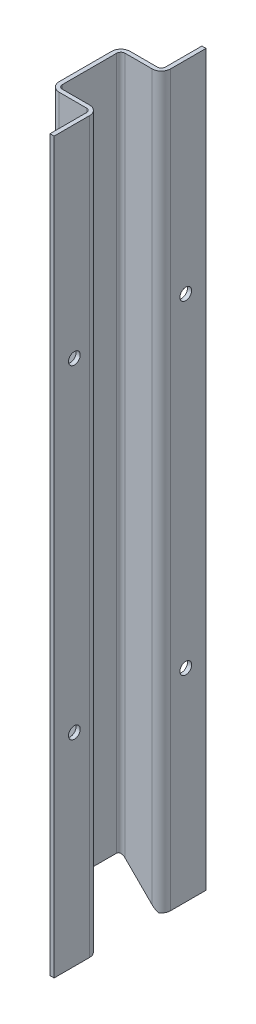
ISO-10303-21;
HEADER;
FILE_DESCRIPTION(('STEP AP214'),'2;1');
FILE_NAME('part.step','',(''),(''),'','','');
FILE_SCHEMA(('AUTOMOTIVE_DESIGN { 1 0 10303 214 1 1 1 1 }'));
ENDSEC;
DATA;
#1=APPLICATION_CONTEXT('core data for automotive mechanical design processes');
#2=APPLICATION_PROTOCOL_DEFINITION('international standard','automotive_design',2000,#1);
#3=PRODUCT_CONTEXT('',#1,'mechanical');
#4=PRODUCT('Part','Part','',(#3));
#5=PRODUCT_RELATED_PRODUCT_CATEGORY('part','',(#4));
#6=PRODUCT_DEFINITION_FORMATION('','',#4);
#7=PRODUCT_DEFINITION_CONTEXT('part definition',#1,'design');
#8=PRODUCT_DEFINITION('design','',#6,#7);
#9=PRODUCT_DEFINITION_SHAPE('','',#8);
#10=(LENGTH_UNIT() NAMED_UNIT(*) SI_UNIT(.MILLI.,.METRE.));
#11=(NAMED_UNIT(*) PLANE_ANGLE_UNIT() SI_UNIT($,.RADIAN.));
#12=(NAMED_UNIT(*) SI_UNIT($,.STERADIAN.) SOLID_ANGLE_UNIT());
#13=UNCERTAINTY_MEASURE_WITH_UNIT(LENGTH_MEASURE(1.E-05),#10,'distance_accuracy_value','');
#14=(GEOMETRIC_REPRESENTATION_CONTEXT(3) GLOBAL_UNCERTAINTY_ASSIGNED_CONTEXT((#13)) GLOBAL_UNIT_ASSIGNED_CONTEXT((#10,
#11,#12)) REPRESENTATION_CONTEXT('',''));
#15=CARTESIAN_POINT('',(0.,0.,0.));
#16=DIRECTION('',(0.,0.,1.));
#17=DIRECTION('',(1.,0.,0.));
#18=AXIS2_PLACEMENT_3D('',#15,#16,#17);
#19=CARTESIAN_POINT('',(162.383781401673,-457.2,-206.271000639954));
#20=DIRECTION('',(0.,0.,-1.));
#21=DIRECTION('',(-1.,0.,0.));
#22=AXIS2_PLACEMENT_3D('',#19,#20,#21);
#23=PLANE('',#22);
#24=DIRECTION('',(-0.707106781186548,0.707106781186548,0.));
#25=VECTOR('',#24,1.);
#26=CARTESIAN_POINT('',(164.092209600915,-446.208428199243,-206.271000639954));
#27=LINE('',#26,#25);
#28=CARTESIAN_POINT('',(172.492981401672,-454.6092,-206.271000639954));
#29=VERTEX_POINT('',#28);
#30=CARTESIAN_POINT('',(155.449581401673,-437.5658,-206.271000639954));
#31=VERTEX_POINT('',#30);
#32=EDGE_CURVE('E321',#29,#31,#27,.T.);
#33=ORIENTED_EDGE('',*,*,#32,.F.);
#34=DIRECTION('',(0.,1.,0.));
#35=VECTOR('',#34,1.);
#36=CARTESIAN_POINT('',(172.492981401672,-457.2,-206.271000639954));
#37=LINE('',#36,#35);
#38=CARTESIAN_POINT('',(172.492981401672,0.,-206.271000639954));
#39=VERTEX_POINT('',#38);
#40=EDGE_CURVE('E288',#29,#39,#37,.T.);
#41=ORIENTED_EDGE('',*,*,#40,.T.);
#42=DIRECTION('',(-1.,0.,0.));
#43=VECTOR('',#42,1.);
#44=CARTESIAN_POINT('',(162.383781401673,0.,-206.271000639954));
#45=LINE('',#44,#43);
#46=CARTESIAN_POINT('',(155.449581401673,0.,-206.271000639954));
#47=VERTEX_POINT('',#46);
#48=EDGE_CURVE('E378',#39,#47,#45,.T.);
#49=ORIENTED_EDGE('',*,*,#48,.T.);
#50=DIRECTION('',(0.,1.,0.));
#51=VECTOR('',#50,1.);
#52=CARTESIAN_POINT('',(155.449581401673,-457.2,-206.271000639954));
#53=LINE('',#52,#51);
#54=EDGE_CURVE('E262',#47,#31,#53,.F.);
#55=ORIENTED_EDGE('',*,*,#54,.T.);
#56=EDGE_LOOP('',(#33,#41,#49,#55));
#57=FACE_BOUND('',#56,.T.);
#58=ADVANCED_FACE('F16',(#57),#23,.F.);
#59=CARTESIAN_POINT('',(163.679181401673,-457.2,-228.496000639954));
#60=DIRECTION('',(0.,-1.,0.));
#61=DIRECTION('',(1.,0.,0.));
#62=AXIS2_PLACEMENT_3D('',#59,#60,#61);
#63=PLANE('',#62);
#64=DIRECTION('',(0.,0.,1.));
#65=VECTOR('',#64,1.);
#66=CARTESIAN_POINT('',(175.083781401672,-457.2,-250.721000639954));
#67=LINE('',#66,#65);
#68=CARTESIAN_POINT('',(175.083781401672,-457.2,-253.311800639953));
#69=VERTEX_POINT('',#68);
#70=CARTESIAN_POINT('',(175.083781401672,-457.2,-249.072959523616));
#71=VERTEX_POINT('',#70);
#72=EDGE_CURVE('E39',#69,#71,#67,.T.);
#73=ORIENTED_EDGE('',*,*,#72,.F.);
#74=DIRECTION('',(0.,0.,-1.));
#75=VECTOR('',#74,1.);
#76=CARTESIAN_POINT('',(175.083781401672,-457.2,-263.421000639953));
#77=LINE('',#76,#75);
#78=CARTESIAN_POINT('',(175.083781401672,-457.2,-276.121000639953));
#79=VERTEX_POINT('',#78);
#80=EDGE_CURVE('E374',#69,#79,#77,.T.);
#81=ORIENTED_EDGE('',*,*,#80,.T.);
#82=DIRECTION('',(1.,0.,0.));
#83=VECTOR('',#82,1.);
#84=CARTESIAN_POINT('',(176.379181401672,-457.2,-276.121000639953));
#85=LINE('',#84,#83);
#86=CARTESIAN_POINT('',(177.674581401672,-457.2,-276.121000639953));
#87=VERTEX_POINT('',#86);
#88=EDGE_CURVE('E377',#79,#87,#85,.T.);
#89=ORIENTED_EDGE('',*,*,#88,.T.);
#90=DIRECTION('',(0.,0.,1.));
#91=VECTOR('',#90,1.);
#92=CARTESIAN_POINT('',(177.674581401672,-457.2,-262.120520639953));
#93=LINE('',#92,#91);
#94=CARTESIAN_POINT('',(177.674581401672,-457.2,-253.885840639953));
#95=VERTEX_POINT('',#94);
#96=EDGE_CURVE('E381',#87,#95,#93,.T.);
#97=ORIENTED_EDGE('',*,*,#96,.T.);
#98=CARTESIAN_POINT('',(171.908781401672,-457.2,-253.885840639953));
#99=DIRECTION('',(0.,-1.,0.));
#100=DIRECTION('',(0.,0.,-1.));
#101=AXIS2_PLACEMENT_3D('',#98,#99,#100);
#102=CIRCLE('',#101,5.7658);
#103=EDGE_CURVE('E239',#95,#71,#102,.T.);
#104=ORIENTED_EDGE('',*,*,#103,.T.);
#105=EDGE_LOOP('',(#73,#81,#89,#97,#104));
#106=FACE_BOUND('',#105,.T.);
#107=ADVANCED_FACE('F483',(#106),#63,.T.);
#108=CARTESIAN_POINT('',(149.683781401672,-457.2,-228.496000639954));
#109=DIRECTION('',(1.,0.,0.));
#110=DIRECTION('',(0.,0.,-1.));
#111=AXIS2_PLACEMENT_3D('',#108,#109,#110);
#112=PLANE('',#111);
#113=DIRECTION('',(0.,1.,0.));
#114=VECTOR('',#113,1.);
#115=CARTESIAN_POINT('',(149.683781401672,-457.2,-244.955200639954));
#116=LINE('',#115,#114);
#117=CARTESIAN_POINT('',(149.683781401672,0.,-244.955200639954));
#118=VERTEX_POINT('',#117);
#119=CARTESIAN_POINT('',(149.683781401672,-431.8,-244.955200639954));
#120=VERTEX_POINT('',#119);
#121=EDGE_CURVE('E221',#118,#120,#116,.F.);
#122=ORIENTED_EDGE('',*,*,#121,.T.);
#123=DIRECTION('',(0.,0.,1.));
#124=VECTOR('',#123,1.);
#125=CARTESIAN_POINT('',(149.683781401672,-431.8,-250.721000639954));
#126=LINE('',#125,#124);
#127=CARTESIAN_POINT('',(149.683781401672,-431.8,-212.036800639953));
#128=VERTEX_POINT('',#127);
#129=EDGE_CURVE('E202',#120,#128,#126,.T.);
#130=ORIENTED_EDGE('',*,*,#129,.T.);
#131=DIRECTION('',(0.,1.,0.));
#132=VECTOR('',#131,1.);
#133=CARTESIAN_POINT('',(149.683781401672,-457.2,-212.036800639953));
#134=LINE('',#133,#132);
#135=CARTESIAN_POINT('',(149.683781401672,0.,-212.036800639953));
#136=VERTEX_POINT('',#135);
#137=EDGE_CURVE('E232',#128,#136,#134,.T.);
#138=ORIENTED_EDGE('',*,*,#137,.T.);
#139=DIRECTION('',(0.,0.,-1.));
#140=VECTOR('',#139,1.);
#141=CARTESIAN_POINT('',(149.683781401672,0.,-228.496000639954));
#142=LINE('',#141,#140);
#143=EDGE_CURVE('E224',#136,#118,#142,.T.);
#144=ORIENTED_EDGE('',*,*,#143,.T.);
#145=EDGE_LOOP('',(#122,#130,#138,#144));
#146=FACE_BOUND('',#145,.T.);
#147=ADVANCED_FACE('F228',(#146),#112,.F.);
#148=CARTESIAN_POINT('',(162.383781401673,-457.2,-250.721000639954));
#149=DIRECTION('',(0.,0.,1.));
#150=DIRECTION('',(1.,0.,0.));
#151=AXIS2_PLACEMENT_3D('',#148,#149,#150);
#152=PLANE('',#151);
#153=DIRECTION('',(1.,0.,0.));
#154=VECTOR('',#153,1.);
#155=CARTESIAN_POINT('',(162.383781401673,0.,-250.721000639954));
#156=LINE('',#155,#154);
#157=CARTESIAN_POINT('',(155.449581401673,0.,-250.721000639954));
#158=VERTEX_POINT('',#157);
#159=CARTESIAN_POINT('',(172.492981401672,0.,-250.721000639954));
#160=VERTEX_POINT('',#159);
#161=EDGE_CURVE('E399',#158,#160,#156,.T.);
#162=ORIENTED_EDGE('',*,*,#161,.T.);
#163=DIRECTION('',(0.,1.,0.));
#164=VECTOR('',#163,1.);
#165=CARTESIAN_POINT('',(172.492981401672,-457.2,-250.721000639954));
#166=LINE('',#165,#164);
#167=CARTESIAN_POINT('',(172.492981401672,-454.6092,-250.721000639954));
#168=VERTEX_POINT('',#167);
#169=EDGE_CURVE('E272',#160,#168,#166,.F.);
#170=ORIENTED_EDGE('',*,*,#169,.T.);
#171=DIRECTION('',(-0.707106781186548,0.707106781186548,0.));
#172=VECTOR('',#171,1.);
#173=CARTESIAN_POINT('',(164.092209600915,-446.208428199243,-250.721000639954));
#174=LINE('',#173,#172);
#175=CARTESIAN_POINT('',(155.449581401673,-437.5658,-250.721000639954));
#176=VERTEX_POINT('',#175);
#177=EDGE_CURVE('E215',#168,#176,#174,.T.);
#178=ORIENTED_EDGE('',*,*,#177,.T.);
#179=DIRECTION('',(0.,1.,0.));
#180=VECTOR('',#179,1.);
#181=CARTESIAN_POINT('',(155.449581401673,-457.2,-250.721000639954));
#182=LINE('',#181,#180);
#183=EDGE_CURVE('E222',#176,#158,#182,.T.);
#184=ORIENTED_EDGE('',*,*,#183,.T.);
#185=EDGE_LOOP('',(#162,#170,#178,#184));
#186=FACE_BOUND('',#185,.T.);
#187=ADVANCED_FACE('F470',(#186),#152,.F.);
#188=CARTESIAN_POINT('',(175.083781401672,-457.2,-263.421000639953));
#189=DIRECTION('',(1.,0.,0.));
#190=DIRECTION('',(0.,0.,-1.));
#191=AXIS2_PLACEMENT_3D('',#188,#189,#190);
#192=PLANE('',#191);
#193=CARTESIAN_POINT('',(175.083781401672,-330.2,-263.421000639953));
#194=DIRECTION('',(1.,0.,0.));
#195=DIRECTION('',(0.,0.,-1.));
#196=AXIS2_PLACEMENT_3D('',#193,#194,#195);
#197=CIRCLE('',#196,3.683);
#198=CARTESIAN_POINT('',(175.083781401672,-330.2,-267.104000639953));
#199=VERTEX_POINT('',#198);
#200=EDGE_CURVE('E20',#199,#199,#197,.F.);
#201=ORIENTED_EDGE('',*,*,#200,.F.);
#202=EDGE_LOOP('',(#201));
#203=FACE_BOUND('',#202,.T.);
#204=CARTESIAN_POINT('',(175.083781401672,-127.,-263.421000639953));
#205=DIRECTION('',(1.,0.,0.));
#206=DIRECTION('',(0.,0.,-1.));
#207=AXIS2_PLACEMENT_3D('',#204,#205,#206);
#208=CIRCLE('',#207,3.683);
#209=CARTESIAN_POINT('',(175.083781401672,-127.,-267.104000639953));
#210=VERTEX_POINT('',#209);
#211=EDGE_CURVE('E327',#210,#210,#208,.F.);
#212=ORIENTED_EDGE('',*,*,#211,.F.);
#213=EDGE_LOOP('',(#212));
#214=FACE_BOUND('',#213,.T.);
#215=ORIENTED_EDGE('',*,*,#80,.F.);
#216=DIRECTION('',(0.,1.,0.));
#217=VECTOR('',#216,1.);
#218=CARTESIAN_POINT('',(175.083781401672,0.,-253.311800639953));
#219=LINE('',#218,#217);
#220=CARTESIAN_POINT('',(175.083781401672,0.,-253.311800639953));
#221=VERTEX_POINT('',#220);
#222=EDGE_CURVE('E268',#69,#221,#219,.T.);
#223=ORIENTED_EDGE('',*,*,#222,.T.);
#224=DIRECTION('',(0.,0.,-1.));
#225=VECTOR('',#224,1.);
#226=CARTESIAN_POINT('',(175.083781401672,0.,-263.421000639953));
#227=LINE('',#226,#225);
#228=CARTESIAN_POINT('',(175.083781401672,0.,-276.121000639953));
#229=VERTEX_POINT('',#228);
#230=EDGE_CURVE('E403',#221,#229,#227,.T.);
#231=ORIENTED_EDGE('',*,*,#230,.T.);
#232=DIRECTION('',(0.,1.,0.));
#233=VECTOR('',#232,1.);
#234=CARTESIAN_POINT('',(175.083781401672,-457.2,-276.121000639953));
#235=LINE('',#234,#233);
#236=EDGE_CURVE('E447',#79,#229,#235,.T.);
#237=ORIENTED_EDGE('',*,*,#236,.F.);
#238=EDGE_LOOP('',(#215,#223,#231,#237));
#239=FACE_BOUND('',#238,.T.);
#240=ADVANCED_FACE('F873',(#203,#214,#239),#192,.F.);
#241=CARTESIAN_POINT('',(176.379181401672,-457.2,-276.121000639953));
#242=DIRECTION('',(0.,0.,1.));
#243=DIRECTION('',(1.,0.,0.));
#244=AXIS2_PLACEMENT_3D('',#241,#242,#243);
#245=PLANE('',#244);
#246=DIRECTION('',(1.,0.,0.));
#247=VECTOR('',#246,1.);
#248=CARTESIAN_POINT('',(176.379181401672,0.,-276.121000639953));
#249=LINE('',#248,#247);
#250=CARTESIAN_POINT('',(177.674581401672,0.,-276.121000639953));
#251=VERTEX_POINT('',#250);
#252=EDGE_CURVE('E406',#229,#251,#249,.T.);
#253=ORIENTED_EDGE('',*,*,#252,.T.);
#254=DIRECTION('',(0.,1.,0.));
#255=VECTOR('',#254,1.);
#256=CARTESIAN_POINT('',(177.674581401672,-457.2,-276.121000639953));
#257=LINE('',#256,#255);
#258=EDGE_CURVE('E443',#87,#251,#257,.T.);
#259=ORIENTED_EDGE('',*,*,#258,.F.);
#260=ORIENTED_EDGE('',*,*,#88,.F.);
#261=ORIENTED_EDGE('',*,*,#236,.T.);
#262=EDGE_LOOP('',(#253,#259,#260,#261));
#263=FACE_BOUND('',#262,.T.);
#264=ADVANCED_FACE('F862',(#263),#245,.F.);
#265=CARTESIAN_POINT('',(177.674581401672,-457.2,-262.120520639953));
#266=DIRECTION('',(-1.,0.,0.));
#267=DIRECTION('',(0.,0.,1.));
#268=AXIS2_PLACEMENT_3D('',#265,#266,#267);
#269=PLANE('',#268);
#270=CARTESIAN_POINT('',(177.674581401672,-330.2,-263.421000639953));
#271=DIRECTION('',(1.,0.,0.));
#272=DIRECTION('',(0.,0.,-1.));
#273=AXIS2_PLACEMENT_3D('',#270,#271,#272);
#274=CIRCLE('',#273,3.683);
#275=CARTESIAN_POINT('',(177.674581401672,-330.2,-267.104000639953));
#276=VERTEX_POINT('',#275);
#277=EDGE_CURVE('E345',#276,#276,#274,.T.);
#278=ORIENTED_EDGE('',*,*,#277,.F.);
#279=EDGE_LOOP('',(#278));
#280=FACE_BOUND('',#279,.T.);
#281=CARTESIAN_POINT('',(177.674581401672,-127.,-263.421000639953));
#282=DIRECTION('',(1.,0.,0.));
#283=DIRECTION('',(0.,0.,-1.));
#284=AXIS2_PLACEMENT_3D('',#281,#282,#283);
#285=CIRCLE('',#284,3.683);
#286=CARTESIAN_POINT('',(177.674581401672,-127.,-267.104000639953));
#287=VERTEX_POINT('',#286);
#288=EDGE_CURVE('E330',#287,#287,#285,.T.);
#289=ORIENTED_EDGE('',*,*,#288,.F.);
#290=EDGE_LOOP('',(#289));
#291=FACE_BOUND('',#290,.T.);
#292=DIRECTION('',(0.,0.,1.));
#293=VECTOR('',#292,1.);
#294=CARTESIAN_POINT('',(177.674581401672,0.,-262.120520639953));
#295=LINE('',#294,#293);
#296=CARTESIAN_POINT('',(177.674581401672,0.,-253.885840639953));
#297=VERTEX_POINT('',#296);
#298=EDGE_CURVE('E409',#251,#297,#295,.T.);
#299=ORIENTED_EDGE('',*,*,#298,.T.);
#300=DIRECTION('',(0.,1.,0.));
#301=VECTOR('',#300,1.);
#302=CARTESIAN_POINT('',(177.674581401672,-457.2,-253.885840639953));
#303=LINE('',#302,#301);
#304=EDGE_CURVE('E251',#297,#95,#303,.F.);
#305=ORIENTED_EDGE('',*,*,#304,.T.);
#306=ORIENTED_EDGE('',*,*,#96,.F.);
#307=ORIENTED_EDGE('',*,*,#258,.T.);
#308=EDGE_LOOP('',(#299,#305,#306,#307));
#309=FACE_BOUND('',#308,.T.);
#310=ADVANCED_FACE('F488',(#280,#291,#309),#269,.F.);
#311=CARTESIAN_POINT('',(176.379181401672,-457.2,-248.120040639953));
#312=DIRECTION('',(0.,0.,-1.));
#313=DIRECTION('',(-1.,0.,0.));
#314=AXIS2_PLACEMENT_3D('',#311,#312,#313);
#315=PLANE('',#314);
#316=DIRECTION('',(-1.,0.,0.));
#317=VECTOR('',#316,1.);
#318=CARTESIAN_POINT('',(176.379181401672,0.,-248.120040639953));
#319=LINE('',#318,#317);
#320=CARTESIAN_POINT('',(171.908781401672,0.,-248.120040639953));
#321=VERTEX_POINT('',#320);
#322=CARTESIAN_POINT('',(154.875541401673,0.,-248.120040639953));
#323=VERTEX_POINT('',#322);
#324=EDGE_CURVE('E413',#321,#323,#319,.T.);
#325=ORIENTED_EDGE('',*,*,#324,.T.);
#326=DIRECTION('',(0.,1.,0.));
#327=VECTOR('',#326,1.);
#328=CARTESIAN_POINT('',(154.875541401673,-434.40096,-248.120040639953));
#329=LINE('',#328,#327);
#330=CARTESIAN_POINT('',(154.875541401673,-436.99176,-248.120040639953));
#331=VERTEX_POINT('',#330);
#332=EDGE_CURVE('E281',#323,#331,#329,.F.);
#333=ORIENTED_EDGE('',*,*,#332,.T.);
#334=DIRECTION('',(0.707106781186548,-0.707106781186548,0.));
#335=VECTOR('',#334,1.);
#336=CARTESIAN_POINT('',(175.731481401672,-457.8477,-248.120040639953));
#337=LINE('',#336,#335);
#338=CARTESIAN_POINT('',(171.908781401672,-454.025,-248.120040639953));
#339=VERTEX_POINT('',#338);
#340=EDGE_CURVE('E368',#331,#339,#337,.T.);
#341=ORIENTED_EDGE('',*,*,#340,.T.);
#342=DIRECTION('',(0.,1.,0.));
#343=VECTOR('',#342,1.);
#344=CARTESIAN_POINT('',(171.908781401672,-457.2,-248.120040639953));
#345=LINE('',#344,#343);
#346=EDGE_CURVE('E248',#339,#321,#345,.T.);
#347=ORIENTED_EDGE('',*,*,#346,.T.);
#348=EDGE_LOOP('',(#325,#333,#341,#347));
#349=FACE_BOUND('',#348,.T.);
#350=ADVANCED_FACE('F494',(#349),#315,.F.);
#351=CARTESIAN_POINT('',(152.284741401673,-457.2,-228.496000639954));
#352=DIRECTION('',(-1.,0.,0.));
#353=DIRECTION('',(0.,0.,1.));
#354=AXIS2_PLACEMENT_3D('',#351,#352,#353);
#355=PLANE('',#354);
#356=DIRECTION('',(0.,0.,-1.));
#357=VECTOR('',#356,1.);
#358=CARTESIAN_POINT('',(152.284741401673,-434.40096,-228.496000639954));
#359=LINE('',#358,#357);
#360=CARTESIAN_POINT('',(152.284741401673,-434.40096,-211.462760639954));
#361=VERTEX_POINT('',#360);
#362=CARTESIAN_POINT('',(152.284741401673,-434.40096,-245.529240639954));
#363=VERTEX_POINT('',#362);
#364=EDGE_CURVE('E364',#361,#363,#359,.T.);
#365=ORIENTED_EDGE('',*,*,#364,.T.);
#366=DIRECTION('',(0.,1.,0.));
#367=VECTOR('',#366,1.);
#368=CARTESIAN_POINT('',(152.284741401673,0.,-245.529240639954));
#369=LINE('',#368,#367);
#370=CARTESIAN_POINT('',(152.284741401673,0.,-245.529240639954));
#371=VERTEX_POINT('',#370);
#372=EDGE_CURVE('E278',#363,#371,#369,.T.);
#373=ORIENTED_EDGE('',*,*,#372,.T.);
#374=DIRECTION('',(0.,0.,1.));
#375=VECTOR('',#374,1.);
#376=CARTESIAN_POINT('',(152.284741401673,0.,-228.496000639954));
#377=LINE('',#376,#375);
#378=CARTESIAN_POINT('',(152.284741401673,0.,-211.462760639954));
#379=VERTEX_POINT('',#378);
#380=EDGE_CURVE('E417',#371,#379,#377,.T.);
#381=ORIENTED_EDGE('',*,*,#380,.T.);
#382=DIRECTION('',(0.,1.,0.));
#383=VECTOR('',#382,1.);
#384=CARTESIAN_POINT('',(152.284741401673,-434.40096,-211.462760639954));
#385=LINE('',#384,#383);
#386=EDGE_CURVE('E275',#379,#361,#385,.F.);
#387=ORIENTED_EDGE('',*,*,#386,.T.);
#388=EDGE_LOOP('',(#365,#373,#381,#387));
#389=FACE_BOUND('',#388,.T.);
#390=ADVANCED_FACE('F502',(#389),#355,.F.);
#391=CARTESIAN_POINT('',(163.684261401673,-457.2,-208.871960639953));
#392=DIRECTION('',(0.,0.,1.));
#393=DIRECTION('',(1.,0.,0.));
#394=AXIS2_PLACEMENT_3D('',#391,#392,#393);
#395=PLANE('',#394);
#396=DIRECTION('',(-0.707106781186548,0.707106781186548,0.));
#397=VECTOR('',#396,1.);
#398=CARTESIAN_POINT('',(169.384021401672,-451.50024,-208.871960639953));
#399=LINE('',#398,#397);
#400=CARTESIAN_POINT('',(171.908781401672,-454.025,-208.871960639953));
#401=VERTEX_POINT('',#400);
#402=CARTESIAN_POINT('',(154.875541401673,-436.99176,-208.871960639953));
#403=VERTEX_POINT('',#402);
#404=EDGE_CURVE('E360',#401,#403,#399,.T.);
#405=ORIENTED_EDGE('',*,*,#404,.T.);
#406=DIRECTION('',(0.,1.,0.));
#407=VECTOR('',#406,1.);
#408=CARTESIAN_POINT('',(154.875541401673,0.,-208.871960639953));
#409=LINE('',#408,#407);
#410=CARTESIAN_POINT('',(154.875541401673,0.,-208.871960639953));
#411=VERTEX_POINT('',#410);
#412=EDGE_CURVE('E284',#403,#411,#409,.T.);
#413=ORIENTED_EDGE('',*,*,#412,.T.);
#414=DIRECTION('',(1.,0.,0.));
#415=VECTOR('',#414,1.);
#416=CARTESIAN_POINT('',(163.684261401673,0.,-208.871960639953));
#417=LINE('',#416,#415);
#418=CARTESIAN_POINT('',(171.908781401672,0.,-208.871960639953));
#419=VERTEX_POINT('',#418);
#420=EDGE_CURVE('E421',#411,#419,#417,.T.);
#421=ORIENTED_EDGE('',*,*,#420,.T.);
#422=DIRECTION('',(0.,1.,0.));
#423=VECTOR('',#422,1.);
#424=CARTESIAN_POINT('',(171.908781401672,-457.2,-208.871960639953));
#425=LINE('',#424,#423);
#426=EDGE_CURVE('E258',#419,#401,#425,.F.);
#427=ORIENTED_EDGE('',*,*,#426,.T.);
#428=EDGE_LOOP('',(#405,#413,#421,#427));
#429=FACE_BOUND('',#428,.T.);
#430=ADVANCED_FACE('F509',(#429),#395,.F.);
#431=CARTESIAN_POINT('',(177.674581401672,-457.2,-194.871480639954));
#432=DIRECTION('',(1.,0.,0.));
#433=DIRECTION('',(0.,0.,-1.));
#434=AXIS2_PLACEMENT_3D('',#431,#432,#433);
#435=PLANE('',#434);
#436=CARTESIAN_POINT('',(177.674581401672,-127.,-193.571000639953));
#437=DIRECTION('',(1.,0.,0.));
#438=DIRECTION('',(0.,0.,-1.));
#439=AXIS2_PLACEMENT_3D('',#436,#437,#438);
#440=CIRCLE('',#439,3.683);
#441=CARTESIAN_POINT('',(177.674581401672,-127.,-197.254000639953));
#442=VERTEX_POINT('',#441);
#443=EDGE_CURVE('E326',#442,#442,#440,.T.);
#444=ORIENTED_EDGE('',*,*,#443,.F.);
#445=EDGE_LOOP('',(#444));
#446=FACE_BOUND('',#445,.T.);
#447=CARTESIAN_POINT('',(177.674581401672,-330.2,-193.571000639953));
#448=DIRECTION('',(1.,0.,0.));
#449=DIRECTION('',(0.,0.,-1.));
#450=AXIS2_PLACEMENT_3D('',#447,#448,#449);
#451=CIRCLE('',#450,3.683);
#452=CARTESIAN_POINT('',(177.674581401672,-330.2,-197.254000639953));
#453=VERTEX_POINT('',#452);
#454=EDGE_CURVE('E322',#453,#453,#451,.T.);
#455=ORIENTED_EDGE('',*,*,#454,.F.);
#456=EDGE_LOOP('',(#455));
#457=FACE_BOUND('',#456,.T.);
#458=DIRECTION('',(0.,0.,-1.));
#459=VECTOR('',#458,1.);
#460=CARTESIAN_POINT('',(177.674581401672,-457.2,-194.871480639954));
#461=LINE('',#460,#459);
#462=CARTESIAN_POINT('',(177.674581401672,-457.2,-180.871000639954));
#463=VERTEX_POINT('',#462);
#464=CARTESIAN_POINT('',(177.674581401672,-457.2,-203.106160639954));
#465=VERTEX_POINT('',#464);
#466=EDGE_CURVE('E385',#463,#465,#461,.T.);
#467=ORIENTED_EDGE('',*,*,#466,.T.);
#468=DIRECTION('',(0.,1.,0.));
#469=VECTOR('',#468,1.);
#470=CARTESIAN_POINT('',(177.674581401672,0.,-203.106160639954));
#471=LINE('',#470,#469);
#472=CARTESIAN_POINT('',(177.674581401672,0.,-203.106160639954));
#473=VERTEX_POINT('',#472);
#474=EDGE_CURVE('E254',#465,#473,#471,.T.);
#475=ORIENTED_EDGE('',*,*,#474,.T.);
#476=DIRECTION('',(0.,0.,-1.));
#477=VECTOR('',#476,1.);
#478=CARTESIAN_POINT('',(177.674581401672,0.,-194.871480639954));
#479=LINE('',#478,#477);
#480=CARTESIAN_POINT('',(177.674581401672,0.,-180.871000639954));
#481=VERTEX_POINT('',#480);
#482=EDGE_CURVE('E424',#481,#473,#479,.T.);
#483=ORIENTED_EDGE('',*,*,#482,.F.);
#484=DIRECTION('',(0.,1.,0.));
#485=VECTOR('',#484,1.);
#486=CARTESIAN_POINT('',(177.674581401672,-457.2,-180.871000639954));
#487=LINE('',#486,#485);
#488=EDGE_CURVE('E440',#463,#481,#487,.T.);
#489=ORIENTED_EDGE('',*,*,#488,.F.);
#490=EDGE_LOOP('',(#467,#475,#483,#489));
#491=FACE_BOUND('',#490,.T.);
#492=ADVANCED_FACE('F685',(#446,#457,#491),#435,.T.);
#493=CARTESIAN_POINT('',(176.379181401672,-457.2,-180.871000639954));
#494=DIRECTION('',(0.,0.,1.));
#495=DIRECTION('',(1.,0.,0.));
#496=AXIS2_PLACEMENT_3D('',#493,#494,#495);
#497=PLANE('',#496);
#498=DIRECTION('',(1.,0.,0.));
#499=VECTOR('',#498,1.);
#500=CARTESIAN_POINT('',(176.379181401672,0.,-180.871000639954));
#501=LINE('',#500,#499);
#502=CARTESIAN_POINT('',(175.083781401672,0.,-180.871000639954));
#503=VERTEX_POINT('',#502);
#504=EDGE_CURVE('E428',#503,#481,#501,.T.);
#505=ORIENTED_EDGE('',*,*,#504,.F.);
#506=DIRECTION('',(0.,1.,0.));
#507=VECTOR('',#506,1.);
#508=CARTESIAN_POINT('',(175.083781401672,-457.2,-180.871000639954));
#509=LINE('',#508,#507);
#510=CARTESIAN_POINT('',(175.083781401672,-457.2,-180.871000639954));
#511=VERTEX_POINT('',#510);
#512=EDGE_CURVE('E396',#511,#503,#509,.T.);
#513=ORIENTED_EDGE('',*,*,#512,.F.);
#514=DIRECTION('',(1.,0.,0.));
#515=VECTOR('',#514,1.);
#516=CARTESIAN_POINT('',(176.379181401672,-457.2,-180.871000639954));
#517=LINE('',#516,#515);
#518=EDGE_CURVE('E389',#511,#463,#517,.T.);
#519=ORIENTED_EDGE('',*,*,#518,.T.);
#520=ORIENTED_EDGE('',*,*,#488,.T.);
#521=EDGE_LOOP('',(#505,#513,#519,#520));
#522=FACE_BOUND('',#521,.T.);
#523=ADVANCED_FACE('F677',(#522),#497,.T.);
#524=CARTESIAN_POINT('',(175.083781401672,-457.2,-193.571000639953));
#525=DIRECTION('',(-1.,0.,0.));
#526=DIRECTION('',(0.,0.,1.));
#527=AXIS2_PLACEMENT_3D('',#524,#525,#526);
#528=PLANE('',#527);
#529=CARTESIAN_POINT('',(175.083781401672,-127.,-193.571000639953));
#530=DIRECTION('',(-1.,0.,0.));
#531=DIRECTION('',(0.,0.,1.));
#532=AXIS2_PLACEMENT_3D('',#529,#530,#531);
#533=CIRCLE('',#532,3.683);
#534=CARTESIAN_POINT('',(175.083781401672,-127.,-189.888000639954));
#535=VERTEX_POINT('',#534);
#536=EDGE_CURVE('E323',#535,#535,#533,.F.);
#537=ORIENTED_EDGE('',*,*,#536,.T.);
#538=EDGE_LOOP('',(#537));
#539=FACE_BOUND('',#538,.T.);
#540=CARTESIAN_POINT('',(175.083781401672,-330.2,-193.571000639953));
#541=DIRECTION('',(-1.,0.,0.));
#542=DIRECTION('',(0.,0.,1.));
#543=AXIS2_PLACEMENT_3D('',#540,#541,#542);
#544=CIRCLE('',#543,3.683);
#545=CARTESIAN_POINT('',(175.083781401672,-330.2,-189.888000639954));
#546=VERTEX_POINT('',#545);
#547=EDGE_CURVE('E317',#546,#546,#544,.F.);
#548=ORIENTED_EDGE('',*,*,#547,.T.);
#549=EDGE_LOOP('',(#548));
#550=FACE_BOUND('',#549,.T.);
#551=DIRECTION('',(0.,0.,1.));
#552=VECTOR('',#551,1.);
#553=CARTESIAN_POINT('',(175.083781401672,0.,-193.571000639953));
#554=LINE('',#553,#552);
#555=CARTESIAN_POINT('',(175.083781401672,0.,-203.680200639954));
#556=VERTEX_POINT('',#555);
#557=EDGE_CURVE('E432',#556,#503,#554,.T.);
#558=ORIENTED_EDGE('',*,*,#557,.F.);
#559=DIRECTION('',(0.,1.,0.));
#560=VECTOR('',#559,1.);
#561=CARTESIAN_POINT('',(175.083781401672,-457.2,-203.680200639954));
#562=LINE('',#561,#560);
#563=CARTESIAN_POINT('',(175.083781401672,-457.2,-203.680200639954));
#564=VERTEX_POINT('',#563);
#565=EDGE_CURVE('E292',#556,#564,#562,.F.);
#566=ORIENTED_EDGE('',*,*,#565,.T.);
#567=DIRECTION('',(0.,0.,1.));
#568=VECTOR('',#567,1.);
#569=CARTESIAN_POINT('',(175.083781401672,-457.2,-193.571000639953));
#570=LINE('',#569,#568);
#571=EDGE_CURVE('E393',#564,#511,#570,.T.);
#572=ORIENTED_EDGE('',*,*,#571,.T.);
#573=ORIENTED_EDGE('',*,*,#512,.T.);
#574=EDGE_LOOP('',(#558,#566,#572,#573));
#575=FACE_BOUND('',#574,.T.);
#576=ADVANCED_FACE('F672',(#539,#550,#575),#528,.T.);
#577=CARTESIAN_POINT('',(175.083781401672,-457.2,-207.919041756292));
#578=VERTEX_POINT('',#577);
#579=EDGE_CURVE('E214',#578,#564,#67,.T.);
#580=ORIENTED_EDGE('',*,*,#579,.F.);
#581=CARTESIAN_POINT('',(171.908781401672,-457.2,-203.106160639954));
#582=DIRECTION('',(0.,-1.,0.));
#583=DIRECTION('',(0.,0.,-1.));
#584=AXIS2_PLACEMENT_3D('',#581,#582,#583);
#585=CIRCLE('',#584,5.7658);
#586=EDGE_CURVE('E231',#578,#465,#585,.T.);
#587=ORIENTED_EDGE('',*,*,#586,.T.);
#588=ORIENTED_EDGE('',*,*,#466,.F.);
#589=ORIENTED_EDGE('',*,*,#518,.F.);
#590=ORIENTED_EDGE('',*,*,#571,.F.);
#591=EDGE_LOOP('',(#580,#587,#588,#589,#590));
#592=FACE_BOUND('',#591,.T.);
#593=ADVANCED_FACE('F519',(#592),#63,.T.);
#594=CARTESIAN_POINT('',(163.679181401673,0.,-228.496000639954));
#595=DIRECTION('',(0.,-1.,0.));
#596=DIRECTION('',(1.,0.,0.));
#597=AXIS2_PLACEMENT_3D('',#594,#595,#596);
#598=PLANE('',#597);
#599=ORIENTED_EDGE('',*,*,#161,.F.);
#600=CARTESIAN_POINT('',(155.449581401673,0.,-244.955200639954));
#601=DIRECTION('',(0.,-1.,0.));
#602=DIRECTION('',(0.,0.,-1.));
#603=AXIS2_PLACEMENT_3D('',#600,#601,#602);
#604=CIRCLE('',#603,5.7658);
#605=EDGE_CURVE('E242',#158,#118,#604,.F.);
#606=ORIENTED_EDGE('',*,*,#605,.T.);
#607=ORIENTED_EDGE('',*,*,#143,.F.);
#608=CARTESIAN_POINT('',(155.449581401673,0.,-212.036800639953));
#609=DIRECTION('',(0.,-1.,0.));
#610=DIRECTION('',(0.,0.,-1.));
#611=AXIS2_PLACEMENT_3D('',#608,#609,#610);
#612=CIRCLE('',#611,5.7658);
#613=EDGE_CURVE('E453',#136,#47,#612,.F.);
#614=ORIENTED_EDGE('',*,*,#613,.T.);
#615=ORIENTED_EDGE('',*,*,#48,.F.);
#616=CARTESIAN_POINT('',(172.492981401672,0.,-203.680200639954));
#617=DIRECTION('',(0.,-1.,0.));
#618=DIRECTION('',(0.,0.,-1.));
#619=AXIS2_PLACEMENT_3D('',#616,#617,#618);
#620=CIRCLE('',#619,2.5908);
#621=EDGE_CURVE('E27',#39,#556,#620,.T.);
#622=ORIENTED_EDGE('',*,*,#621,.T.);
#623=ORIENTED_EDGE('',*,*,#557,.T.);
#624=ORIENTED_EDGE('',*,*,#504,.T.);
#625=ORIENTED_EDGE('',*,*,#482,.T.);
#626=CARTESIAN_POINT('',(171.908781401672,0.,-203.106160639954));
#627=DIRECTION('',(0.,-1.,0.));
#628=DIRECTION('',(0.,0.,-1.));
#629=AXIS2_PLACEMENT_3D('',#626,#627,#628);
#630=CIRCLE('',#629,5.7658);
#631=EDGE_CURVE('E457',#473,#419,#630,.F.);
#632=ORIENTED_EDGE('',*,*,#631,.T.);
#633=ORIENTED_EDGE('',*,*,#420,.F.);
#634=CARTESIAN_POINT('',(154.875541401673,0.,-211.462760639954));
#635=DIRECTION('',(0.,-1.,0.));
#636=DIRECTION('',(0.,0.,-1.));
#637=AXIS2_PLACEMENT_3D('',#634,#635,#636);
#638=CIRCLE('',#637,2.5908);
#639=EDGE_CURVE('E309',#411,#379,#638,.T.);
#640=ORIENTED_EDGE('',*,*,#639,.T.);
#641=ORIENTED_EDGE('',*,*,#380,.F.);
#642=CARTESIAN_POINT('',(154.875541401673,0.,-245.529240639954));
#643=DIRECTION('',(0.,-1.,0.));
#644=DIRECTION('',(0.,0.,-1.));
#645=AXIS2_PLACEMENT_3D('',#642,#643,#644);
#646=CIRCLE('',#645,2.5908);
#647=EDGE_CURVE('E303',#371,#323,#646,.T.);
#648=ORIENTED_EDGE('',*,*,#647,.T.);
#649=ORIENTED_EDGE('',*,*,#324,.F.);
#650=CARTESIAN_POINT('',(171.908781401672,0.,-253.885840639953));
#651=DIRECTION('',(0.,-1.,0.));
#652=DIRECTION('',(0.,0.,-1.));
#653=AXIS2_PLACEMENT_3D('',#650,#651,#652);
#654=CIRCLE('',#653,5.7658);
#655=EDGE_CURVE('E461',#321,#297,#654,.F.);
#656=ORIENTED_EDGE('',*,*,#655,.T.);
#657=ORIENTED_EDGE('',*,*,#298,.F.);
#658=ORIENTED_EDGE('',*,*,#252,.F.);
#659=ORIENTED_EDGE('',*,*,#230,.F.);
#660=CARTESIAN_POINT('',(172.492981401672,0.,-253.311800639953));
#661=DIRECTION('',(0.,-1.,0.));
#662=DIRECTION('',(0.,0.,-1.));
#663=AXIS2_PLACEMENT_3D('',#660,#661,#662);
#664=CIRCLE('',#663,2.5908);
#665=EDGE_CURVE('E296',#221,#160,#664,.T.);
#666=ORIENTED_EDGE('',*,*,#665,.T.);
#667=EDGE_LOOP('',(#599,#606,#607,#614,#615,#622,#623,#624,#625,#632,#633,#640,#641,#648,#649,
#656,#657,#658,#659,#666));
#668=FACE_BOUND('',#667,.T.);
#669=ADVANCED_FACE('F466',(#668),#598,.F.);
#670=CARTESIAN_POINT('',(155.449581401673,-457.2,-244.955200639954));
#671=DIRECTION('',(0.,1.,0.));
#672=DIRECTION('',(0.,0.,1.));
#673=AXIS2_PLACEMENT_3D('',#670,#671,#672);
#674=CYLINDRICAL_SURFACE('',#673,5.7658);
#675=CARTESIAN_POINT('',(155.449581401673,-437.5658,-244.955200639954));
#676=DIRECTION('',(0.707106781186547,0.707106781186548,0.));
#677=DIRECTION('',(-0.707106781186548,0.707106781186547,0.));
#678=AXIS2_PLACEMENT_3D('',#675,#676,#677);
#679=ELLIPSE('',#678,8.15407255793079,5.7658);
#680=EDGE_CURVE('E206',#120,#176,#679,.F.);
#681=ORIENTED_EDGE('',*,*,#680,.F.);
#682=ORIENTED_EDGE('',*,*,#121,.F.);
#683=ORIENTED_EDGE('',*,*,#605,.F.);
#684=ORIENTED_EDGE('',*,*,#183,.F.);
#685=EDGE_LOOP('',(#681,#682,#683,#684));
#686=FACE_BOUND('',#685,.T.);
#687=ADVANCED_FACE('F219',(#686),#674,.T.);
#688=CARTESIAN_POINT('',(171.908781401672,-457.2,-253.885840639953));
#689=DIRECTION('',(0.,1.,0.));
#690=DIRECTION('',(0.,0.,1.));
#691=AXIS2_PLACEMENT_3D('',#688,#689,#690);
#692=CYLINDRICAL_SURFACE('',#691,5.7658);
#693=CARTESIAN_POINT('',(171.908781401672,-454.025,-253.885840639953));
#694=DIRECTION('',(0.707106781186547,0.707106781186548,0.));
#695=DIRECTION('',(-0.707106781186548,0.707106781186547,0.));
#696=AXIS2_PLACEMENT_3D('',#693,#694,#695);
#697=ELLIPSE('',#696,8.15407255793079,5.7658);
#698=EDGE_CURVE('E225',#71,#339,#697,.F.);
#699=ORIENTED_EDGE('',*,*,#698,.F.);
#700=ORIENTED_EDGE('',*,*,#103,.F.);
#701=ORIENTED_EDGE('',*,*,#304,.F.);
#702=ORIENTED_EDGE('',*,*,#655,.F.);
#703=ORIENTED_EDGE('',*,*,#346,.F.);
#704=EDGE_LOOP('',(#699,#700,#701,#702,#703));
#705=FACE_BOUND('',#704,.T.);
#706=ADVANCED_FACE('F480',(#705),#692,.T.);
#707=CARTESIAN_POINT('',(171.908781401672,-457.2,-203.106160639954));
#708=DIRECTION('',(0.,-1.,0.));
#709=DIRECTION('',(0.,0.,-1.));
#710=AXIS2_PLACEMENT_3D('',#707,#708,#709);
#711=CYLINDRICAL_SURFACE('',#710,5.7658);
#712=CARTESIAN_POINT('',(171.908781401672,-454.025,-203.106160639954));
#713=DIRECTION('',(0.707106781186547,0.707106781186548,0.));
#714=DIRECTION('',(0.707106781186548,-0.707106781186547,0.));
#715=AXIS2_PLACEMENT_3D('',#712,#713,#714);
#716=ELLIPSE('',#715,8.15407255793079,5.7658);
#717=EDGE_CURVE('E357',#401,#578,#716,.F.);
#718=ORIENTED_EDGE('',*,*,#717,.F.);
#719=ORIENTED_EDGE('',*,*,#426,.F.);
#720=ORIENTED_EDGE('',*,*,#631,.F.);
#721=ORIENTED_EDGE('',*,*,#474,.F.);
#722=ORIENTED_EDGE('',*,*,#586,.F.);
#723=EDGE_LOOP('',(#718,#719,#720,#721,#722));
#724=FACE_BOUND('',#723,.T.);
#725=ADVANCED_FACE('F513',(#724),#711,.T.);
#726=CARTESIAN_POINT('',(155.449581401673,-457.2,-212.036800639953));
#727=DIRECTION('',(0.,1.,0.));
#728=DIRECTION('',(0.,0.,1.));
#729=AXIS2_PLACEMENT_3D('',#726,#727,#728);
#730=CYLINDRICAL_SURFACE('',#729,5.7658);
#731=CARTESIAN_POINT('',(155.449581401673,-437.5658,-212.036800639953));
#732=DIRECTION('',(0.707106781186547,0.707106781186548,0.));
#733=DIRECTION('',(-0.707106781186548,0.707106781186547,0.));
#734=AXIS2_PLACEMENT_3D('',#731,#732,#733);
#735=ELLIPSE('',#734,8.15407255793079,5.7658);
#736=EDGE_CURVE('E209',#31,#128,#735,.F.);
#737=ORIENTED_EDGE('',*,*,#736,.F.);
#738=ORIENTED_EDGE('',*,*,#54,.F.);
#739=ORIENTED_EDGE('',*,*,#613,.F.);
#740=ORIENTED_EDGE('',*,*,#137,.F.);
#741=EDGE_LOOP('',(#737,#738,#739,#740));
#742=FACE_BOUND('',#741,.T.);
#743=ADVANCED_FACE('F758',(#742),#730,.T.);
#744=CARTESIAN_POINT('',(164.092209600915,-446.208428199243,-250.721000639954));
#745=DIRECTION('',(0.707106781186547,0.707106781186548,0.));
#746=DIRECTION('',(-0.707106781186548,0.707106781186547,0.));
#747=AXIS2_PLACEMENT_3D('',#744,#745,#746);
#748=PLANE('',#747);
#749=ORIENTED_EDGE('',*,*,#680,.T.);
#750=ORIENTED_EDGE('',*,*,#177,.F.);
#751=CARTESIAN_POINT('',(172.492981401672,-454.6092,-253.311800639953));
#752=DIRECTION('',(0.707106781186547,0.707106781186548,0.));
#753=DIRECTION('',(0.707106781186548,-0.707106781186547,0.));
#754=AXIS2_PLACEMENT_3D('',#751,#752,#753);
#755=ELLIPSE('',#754,3.66394449739622,2.5908);
#756=EDGE_CURVE('E299',#168,#69,#755,.T.);
#757=ORIENTED_EDGE('',*,*,#756,.T.);
#758=ORIENTED_EDGE('',*,*,#72,.T.);
#759=ORIENTED_EDGE('',*,*,#698,.T.);
#760=ORIENTED_EDGE('',*,*,#340,.F.);
#761=CARTESIAN_POINT('',(154.875541401673,-436.99176,-245.529240639954));
#762=DIRECTION('',(0.707106781186547,0.707106781186548,0.));
#763=DIRECTION('',(0.707106781186548,-0.707106781186547,0.));
#764=AXIS2_PLACEMENT_3D('',#761,#762,#763);
#765=ELLIPSE('',#764,3.66394449739622,2.5908);
#766=EDGE_CURVE('E306',#331,#363,#765,.T.);
#767=ORIENTED_EDGE('',*,*,#766,.T.);
#768=ORIENTED_EDGE('',*,*,#364,.F.);
#769=CARTESIAN_POINT('',(154.875541401673,-436.99176,-211.462760639954));
#770=DIRECTION('',(0.707106781186547,0.707106781186548,0.));
#771=DIRECTION('',(0.707106781186548,-0.707106781186547,0.));
#772=AXIS2_PLACEMENT_3D('',#769,#770,#771);
#773=ELLIPSE('',#772,3.66394449739622,2.5908);
#774=EDGE_CURVE('E312',#361,#403,#773,.T.);
#775=ORIENTED_EDGE('',*,*,#774,.T.);
#776=ORIENTED_EDGE('',*,*,#404,.F.);
#777=ORIENTED_EDGE('',*,*,#717,.T.);
#778=ORIENTED_EDGE('',*,*,#579,.T.);
#779=CARTESIAN_POINT('',(172.492981401672,-454.6092,-203.680200639954));
#780=DIRECTION('',(0.707106781186547,0.707106781186548,0.));
#781=DIRECTION('',(-0.707106781186548,0.707106781186547,0.));
#782=AXIS2_PLACEMENT_3D('',#779,#780,#781);
#783=ELLIPSE('',#782,3.66394449739622,2.5908);
#784=EDGE_CURVE('E11',#564,#29,#783,.T.);
#785=ORIENTED_EDGE('',*,*,#784,.T.);
#786=ORIENTED_EDGE('',*,*,#32,.T.);
#787=ORIENTED_EDGE('',*,*,#736,.T.);
#788=ORIENTED_EDGE('',*,*,#129,.F.);
#789=EDGE_LOOP('',(#749,#750,#757,#758,#759,#760,#767,#768,#775,#776,#777,#778,#785,#786,#787,#788));
#790=FACE_BOUND('',#789,.T.);
#791=ADVANCED_FACE('F204',(#790),#748,.F.);
#792=CARTESIAN_POINT('',(172.492981401672,-457.2,-253.311800639953));
#793=DIRECTION('',(0.,-1.,0.));
#794=DIRECTION('',(0.,0.,-1.));
#795=AXIS2_PLACEMENT_3D('',#792,#793,#794);
#796=CYLINDRICAL_SURFACE('',#795,2.5908);
#797=ORIENTED_EDGE('',*,*,#756,.F.);
#798=ORIENTED_EDGE('',*,*,#169,.F.);
#799=ORIENTED_EDGE('',*,*,#665,.F.);
#800=ORIENTED_EDGE('',*,*,#222,.F.);
#801=EDGE_LOOP('',(#797,#798,#799,#800));
#802=FACE_BOUND('',#801,.T.);
#803=ADVANCED_FACE('F473',(#802),#796,.F.);
#804=CARTESIAN_POINT('',(154.875541401673,-457.2,-245.529240639954));
#805=DIRECTION('',(0.,-1.,0.));
#806=DIRECTION('',(0.,0.,-1.));
#807=AXIS2_PLACEMENT_3D('',#804,#805,#806);
#808=CYLINDRICAL_SURFACE('',#807,2.5908);
#809=ORIENTED_EDGE('',*,*,#766,.F.);
#810=ORIENTED_EDGE('',*,*,#332,.F.);
#811=ORIENTED_EDGE('',*,*,#647,.F.);
#812=ORIENTED_EDGE('',*,*,#372,.F.);
#813=EDGE_LOOP('',(#809,#810,#811,#812));
#814=FACE_BOUND('',#813,.T.);
#815=ADVANCED_FACE('F497',(#814),#808,.F.);
#816=CARTESIAN_POINT('',(154.875541401673,-457.2,-211.462760639954));
#817=DIRECTION('',(0.,-1.,0.));
#818=DIRECTION('',(0.,0.,-1.));
#819=AXIS2_PLACEMENT_3D('',#816,#817,#818);
#820=CYLINDRICAL_SURFACE('',#819,2.5908);
#821=ORIENTED_EDGE('',*,*,#774,.F.);
#822=ORIENTED_EDGE('',*,*,#386,.F.);
#823=ORIENTED_EDGE('',*,*,#639,.F.);
#824=ORIENTED_EDGE('',*,*,#412,.F.);
#825=EDGE_LOOP('',(#821,#822,#823,#824));
#826=FACE_BOUND('',#825,.T.);
#827=ADVANCED_FACE('F505',(#826),#820,.F.);
#828=CARTESIAN_POINT('',(172.492981401672,-457.2,-203.680200639954));
#829=DIRECTION('',(0.,1.,0.));
#830=DIRECTION('',(0.,0.,1.));
#831=AXIS2_PLACEMENT_3D('',#828,#829,#830);
#832=CYLINDRICAL_SURFACE('',#831,2.5908);
#833=ORIENTED_EDGE('',*,*,#784,.F.);
#834=ORIENTED_EDGE('',*,*,#565,.F.);
#835=ORIENTED_EDGE('',*,*,#621,.F.);
#836=ORIENTED_EDGE('',*,*,#40,.F.);
#837=EDGE_LOOP('',(#833,#834,#835,#836));
#838=FACE_BOUND('',#837,.T.);
#839=ADVANCED_FACE('F18',(#838),#832,.F.);
#840=CARTESIAN_POINT('',(-291.286461367633,-330.2,-193.571000639953));
#841=DIRECTION('',(1.,0.,0.));
#842=DIRECTION('',(0.,0.,-1.));
#843=AXIS2_PLACEMENT_3D('',#840,#841,#842);
#844=CYLINDRICAL_SURFACE('',#843,3.683);
#845=ORIENTED_EDGE('',*,*,#547,.F.);
#846=EDGE_LOOP('',(#845));
#847=FACE_BOUND('',#846,.T.);
#848=ORIENTED_EDGE('',*,*,#454,.T.);
#849=EDGE_LOOP('',(#848));
#850=FACE_BOUND('',#849,.T.);
#851=ADVANCED_FACE('F697',(#847,#850),#844,.F.);
#852=CARTESIAN_POINT('',(-291.286461367633,-127.,-193.571000639953));
#853=DIRECTION('',(1.,0.,0.));
#854=DIRECTION('',(0.,0.,-1.));
#855=AXIS2_PLACEMENT_3D('',#852,#853,#854);
#856=CYLINDRICAL_SURFACE('',#855,3.683);
#857=ORIENTED_EDGE('',*,*,#536,.F.);
#858=EDGE_LOOP('',(#857));
#859=FACE_BOUND('',#858,.T.);
#860=ORIENTED_EDGE('',*,*,#443,.T.);
#861=EDGE_LOOP('',(#860));
#862=FACE_BOUND('',#861,.T.);
#863=ADVANCED_FACE('F661',(#859,#862),#856,.F.);
#864=CARTESIAN_POINT('',(-291.286461367633,-127.,-263.421000639953));
#865=DIRECTION('',(1.,0.,0.));
#866=DIRECTION('',(0.,0.,-1.));
#867=AXIS2_PLACEMENT_3D('',#864,#865,#866);
#868=CYLINDRICAL_SURFACE('',#867,3.683);
#869=ORIENTED_EDGE('',*,*,#288,.T.);
#870=EDGE_LOOP('',(#869));
#871=FACE_BOUND('',#870,.T.);
#872=ORIENTED_EDGE('',*,*,#211,.T.);
#873=EDGE_LOOP('',(#872));
#874=FACE_BOUND('',#873,.T.);
#875=ADVANCED_FACE('F656',(#871,#874),#868,.F.);
#876=CARTESIAN_POINT('',(-291.286461367633,-330.2,-263.421000639953));
#877=DIRECTION('',(1.,0.,0.));
#878=DIRECTION('',(0.,0.,-1.));
#879=AXIS2_PLACEMENT_3D('',#876,#877,#878);
#880=CYLINDRICAL_SURFACE('',#879,3.683);
#881=ORIENTED_EDGE('',*,*,#277,.T.);
#882=EDGE_LOOP('',(#881));
#883=FACE_BOUND('',#882,.T.);
#884=ORIENTED_EDGE('',*,*,#200,.T.);
#885=EDGE_LOOP('',(#884));
#886=FACE_BOUND('',#885,.T.);
#887=ADVANCED_FACE('F660',(#883,#886),#880,.F.);
#888=CLOSED_SHELL('',(#58,#107,#147,#187,#240,#264,#310,#350,#390,#430,#492,#523,#576,#593,#669,
#687,#706,#725,#743,#791,#803,#815,#827,#839,#851,#863,#875,#887));
#889=MANIFOLD_SOLID_BREP('B1',#888);
#890=ADVANCED_BREP_SHAPE_REPRESENTATION('',(#18,#889),#14);
#891=SHAPE_DEFINITION_REPRESENTATION(#9,#890);
ENDSEC;
END-ISO-10303-21;
